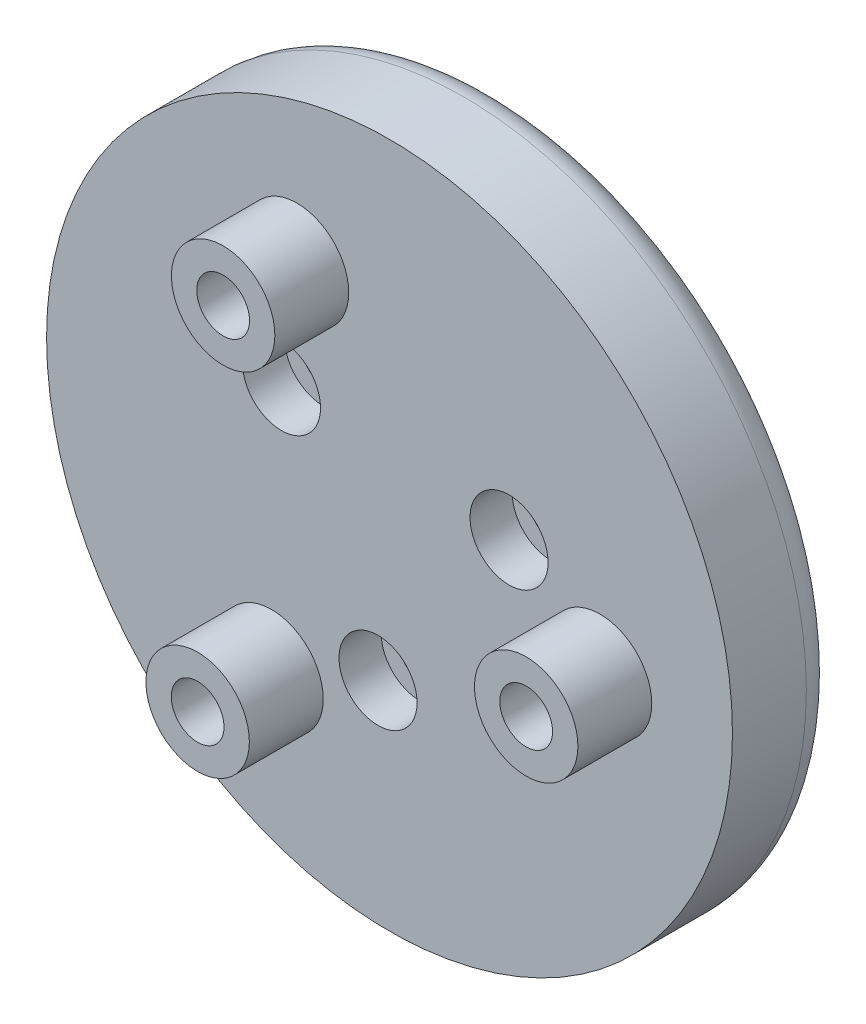
ISO-10303-21;
HEADER;
FILE_DESCRIPTION(('STEP AP214'),'2;1');
FILE_NAME('part.step','',(''),(''),'','','');
FILE_SCHEMA(('AUTOMOTIVE_DESIGN { 1 0 10303 214 1 1 1 1 }'));
ENDSEC;
DATA;
#1=APPLICATION_CONTEXT('core data for automotive mechanical design processes');
#2=APPLICATION_PROTOCOL_DEFINITION('international standard','automotive_design',2000,#1);
#3=PRODUCT_CONTEXT('',#1,'mechanical');
#4=PRODUCT('Part','Part','',(#3));
#5=PRODUCT_RELATED_PRODUCT_CATEGORY('part','',(#4));
#6=PRODUCT_DEFINITION_FORMATION('','',#4);
#7=PRODUCT_DEFINITION_CONTEXT('part definition',#1,'design');
#8=PRODUCT_DEFINITION('design','',#6,#7);
#9=PRODUCT_DEFINITION_SHAPE('','',#8);
#10=(LENGTH_UNIT() NAMED_UNIT(*) SI_UNIT(.MILLI.,.METRE.));
#11=(NAMED_UNIT(*) PLANE_ANGLE_UNIT() SI_UNIT($,.RADIAN.));
#12=(NAMED_UNIT(*) SI_UNIT($,.STERADIAN.) SOLID_ANGLE_UNIT());
#13=UNCERTAINTY_MEASURE_WITH_UNIT(LENGTH_MEASURE(1.E-05),#10,'distance_accuracy_value','');
#14=(GEOMETRIC_REPRESENTATION_CONTEXT(3) GLOBAL_UNCERTAINTY_ASSIGNED_CONTEXT((#13)) GLOBAL_UNIT_ASSIGNED_CONTEXT((#10,
#11,#12)) REPRESENTATION_CONTEXT('',''));
#15=CARTESIAN_POINT('',(0.,0.,0.));
#16=DIRECTION('',(0.,0.,1.));
#17=DIRECTION('',(1.,0.,0.));
#18=AXIS2_PLACEMENT_3D('',#15,#16,#17);
#19=CARTESIAN_POINT('',(-0.544723392172865,-6.22621686307341,5.));
#20=DIRECTION('',(0.,0.,-1.));
#21=DIRECTION('',(-1.,0.,0.));
#22=AXIS2_PLACEMENT_3D('',#19,#20,#21);
#23=CYLINDRICAL_SURFACE('',#22,1.);
#24=CARTESIAN_POINT('',(-0.544723392172865,-6.22621686307341,0.));
#25=DIRECTION('',(0.,0.,1.));
#26=DIRECTION('',(1.,0.,0.));
#27=AXIS2_PLACEMENT_3D('',#24,#25,#26);
#28=CIRCLE('',#27,1.);
#29=CARTESIAN_POINT('',(0.455276607827135,-6.22621686307341,0.));
#30=VERTEX_POINT('',#29);
#31=EDGE_CURVE('E117',#30,#30,#28,.T.);
#32=ORIENTED_EDGE('',*,*,#31,.F.);
#33=EDGE_LOOP('',(#32));
#34=FACE_BOUND('',#33,.T.);
#35=CARTESIAN_POINT('',(-0.544723392172865,-6.22621686307341,3.));
#36=DIRECTION('',(0.,0.,1.));
#37=DIRECTION('',(1.,0.,0.));
#38=AXIS2_PLACEMENT_3D('',#35,#36,#37);
#39=CIRCLE('',#38,1.);
#40=CARTESIAN_POINT('',(0.455276607827135,-6.22621686307341,3.));
#41=VERTEX_POINT('',#40);
#42=EDGE_CURVE('E34',#41,#41,#39,.T.);
#43=ORIENTED_EDGE('',*,*,#42,.T.);
#44=EDGE_LOOP('',(#43));
#45=FACE_BOUND('',#44,.T.);
#46=ADVANCED_FACE('F30',(#34,#45),#23,.F.);
#47=CARTESIAN_POINT('',(-5.11970027680618,3.58485272719406,5.));
#48=DIRECTION('',(0.,0.,-1.));
#49=DIRECTION('',(-1.,0.,0.));
#50=AXIS2_PLACEMENT_3D('',#47,#48,#49);
#51=CYLINDRICAL_SURFACE('',#50,1.);
#52=CARTESIAN_POINT('',(-5.11970027680618,3.58485272719406,0.));
#53=DIRECTION('',(0.,0.,1.));
#54=DIRECTION('',(1.,0.,0.));
#55=AXIS2_PLACEMENT_3D('',#52,#53,#54);
#56=CIRCLE('',#55,1.);
#57=CARTESIAN_POINT('',(-4.11970027680618,3.58485272719406,0.));
#58=VERTEX_POINT('',#57);
#59=EDGE_CURVE('E114',#58,#58,#56,.T.);
#60=ORIENTED_EDGE('',*,*,#59,.F.);
#61=EDGE_LOOP('',(#60));
#62=FACE_BOUND('',#61,.T.);
#63=CARTESIAN_POINT('',(-5.11970027680618,3.58485272719406,3.));
#64=DIRECTION('',(0.,0.,1.));
#65=DIRECTION('',(1.,0.,0.));
#66=AXIS2_PLACEMENT_3D('',#63,#64,#65);
#67=CIRCLE('',#66,1.);
#68=CARTESIAN_POINT('',(-4.11970027680618,3.58485272719406,3.));
#69=VERTEX_POINT('',#68);
#70=EDGE_CURVE('E51',#69,#69,#67,.T.);
#71=ORIENTED_EDGE('',*,*,#70,.T.);
#72=EDGE_LOOP('',(#71));
#73=FACE_BOUND('',#72,.T.);
#74=ADVANCED_FACE('F138',(#62,#73),#51,.F.);
#75=CARTESIAN_POINT('',(5.66442366897905,2.6413641358794,5.));
#76=DIRECTION('',(0.,0.,-1.));
#77=DIRECTION('',(-1.,0.,0.));
#78=AXIS2_PLACEMENT_3D('',#75,#76,#77);
#79=CYLINDRICAL_SURFACE('',#78,1.);
#80=CARTESIAN_POINT('',(5.66442366897905,2.6413641358794,0.));
#81=DIRECTION('',(0.,0.,1.));
#82=DIRECTION('',(1.,0.,0.));
#83=AXIS2_PLACEMENT_3D('',#80,#81,#82);
#84=CIRCLE('',#83,1.);
#85=CARTESIAN_POINT('',(6.66442366897905,2.6413641358794,0.));
#86=VERTEX_POINT('',#85);
#87=EDGE_CURVE('E111',#86,#86,#84,.T.);
#88=ORIENTED_EDGE('',*,*,#87,.F.);
#89=EDGE_LOOP('',(#88));
#90=FACE_BOUND('',#89,.T.);
#91=CARTESIAN_POINT('',(5.66442366897905,2.6413641358794,3.));
#92=DIRECTION('',(0.,0.,1.));
#93=DIRECTION('',(1.,0.,0.));
#94=AXIS2_PLACEMENT_3D('',#91,#92,#93);
#95=CIRCLE('',#94,1.);
#96=CARTESIAN_POINT('',(6.66442366897905,2.6413641358794,3.));
#97=VERTEX_POINT('',#96);
#98=EDGE_CURVE('E47',#97,#97,#95,.T.);
#99=ORIENTED_EDGE('',*,*,#98,.T.);
#100=EDGE_LOOP('',(#99));
#101=FACE_BOUND('',#100,.T.);
#102=ADVANCED_FACE('F144',(#90,#101),#79,.F.);
#103=CARTESIAN_POINT('',(0.,0.,5.));
#104=DIRECTION('',(0.,0.,1.));
#105=DIRECTION('',(1.,0.,0.));
#106=AXIS2_PLACEMENT_3D('',#103,#104,#105);
#107=PLANE('',#106);
#108=CARTESIAN_POINT('',(-5.11970027680618,3.58485272719406,5.));
#109=DIRECTION('',(0.,0.,1.));
#110=DIRECTION('',(1.,0.,0.));
#111=AXIS2_PLACEMENT_3D('',#108,#109,#110);
#112=CIRCLE('',#111,1.85);
#113=CARTESIAN_POINT('',(-3.26970027680618,3.58485272719406,5.));
#114=VERTEX_POINT('',#113);
#115=EDGE_CURVE('E59',#114,#114,#112,.T.);
#116=ORIENTED_EDGE('',*,*,#115,.F.);
#117=EDGE_LOOP('',(#116));
#118=FACE_BOUND('',#117,.T.);
#119=CARTESIAN_POINT('',(-0.544723392172865,-6.22621686307341,5.));
#120=DIRECTION('',(0.,0.,1.));
#121=DIRECTION('',(1.,0.,0.));
#122=AXIS2_PLACEMENT_3D('',#119,#120,#121);
#123=CIRCLE('',#122,1.85);
#124=CARTESIAN_POINT('',(1.30527660782714,-6.22621686307341,5.));
#125=VERTEX_POINT('',#124);
#126=EDGE_CURVE('E69',#125,#125,#123,.T.);
#127=ORIENTED_EDGE('',*,*,#126,.F.);
#128=EDGE_LOOP('',(#127));
#129=FACE_BOUND('',#128,.T.);
#130=CARTESIAN_POINT('',(5.66442366897905,2.6413641358794,5.));
#131=DIRECTION('',(0.,0.,1.));
#132=DIRECTION('',(1.,0.,0.));
#133=AXIS2_PLACEMENT_3D('',#130,#131,#132);
#134=CIRCLE('',#133,1.85);
#135=CARTESIAN_POINT('',(7.51442366897905,2.6413641358794,5.));
#136=VERTEX_POINT('',#135);
#137=EDGE_CURVE('E57',#136,#136,#134,.T.);
#138=ORIENTED_EDGE('',*,*,#137,.F.);
#139=EDGE_LOOP('',(#138));
#140=FACE_BOUND('',#139,.T.);
#141=CARTESIAN_POINT('',(9.97564050259824,-0.697564737441358,5.));
#142=DIRECTION('',(0.,0.,1.));
#143=DIRECTION('',(1.,0.,0.));
#144=AXIS2_PLACEMENT_3D('',#141,#142,#143);
#145=CIRCLE('',#144,2.45);
#146=CARTESIAN_POINT('',(12.4256405025982,-0.697564737441358,5.));
#147=VERTEX_POINT('',#146);
#148=EDGE_CURVE('E84',#147,#147,#145,.T.);
#149=ORIENTED_EDGE('',*,*,#148,.F.);
#150=EDGE_LOOP('',(#149));
#151=FACE_BOUND('',#150,.T.);
#152=CARTESIAN_POINT('',(-4.38371146789072,8.9879404629917,5.));
#153=DIRECTION('',(0.,0.,1.));
#154=DIRECTION('',(1.,0.,0.));
#155=AXIS2_PLACEMENT_3D('',#152,#153,#154);
#156=CIRCLE('',#155,2.45);
#157=CARTESIAN_POINT('',(-1.93371146789072,8.9879404629917,5.));
#158=VERTEX_POINT('',#157);
#159=EDGE_CURVE('E88',#158,#158,#156,.T.);
#160=ORIENTED_EDGE('',*,*,#159,.F.);
#161=EDGE_LOOP('',(#160));
#162=FACE_BOUND('',#161,.T.);
#163=CARTESIAN_POINT('',(-5.59192903470748,-8.29037572555041,5.));
#164=DIRECTION('',(0.,0.,1.));
#165=DIRECTION('',(1.,0.,0.));
#166=AXIS2_PLACEMENT_3D('',#163,#164,#165);
#167=CIRCLE('',#166,2.45);
#168=CARTESIAN_POINT('',(-3.14192903470748,-8.29037572555041,5.));
#169=VERTEX_POINT('',#168);
#170=EDGE_CURVE('E94',#169,#169,#167,.T.);
#171=ORIENTED_EDGE('',*,*,#170,.F.);
#172=EDGE_LOOP('',(#171));
#173=FACE_BOUND('',#172,.T.);
#174=CARTESIAN_POINT('',(0.,0.,5.));
#175=DIRECTION('',(0.,0.,1.));
#176=DIRECTION('',(1.,0.,0.));
#177=AXIS2_PLACEMENT_3D('',#174,#175,#176);
#178=CIRCLE('',#177,16.25);
#179=CARTESIAN_POINT('',(16.25,0.,5.));
#180=VERTEX_POINT('',#179);
#181=EDGE_CURVE('E43',#180,#180,#178,.T.);
#182=ORIENTED_EDGE('',*,*,#181,.T.);
#183=EDGE_LOOP('',(#182));
#184=FACE_BOUND('',#183,.T.);
#185=ADVANCED_FACE('F122',(#118,#129,#140,#151,#162,#173,#184),#107,.T.);
#186=CARTESIAN_POINT('',(0.,0.,0.));
#187=DIRECTION('',(0.,0.,1.));
#188=DIRECTION('',(1.,0.,0.));
#189=AXIS2_PLACEMENT_3D('',#186,#187,#188);
#190=PLANE('',#189);
#191=CARTESIAN_POINT('',(0.,0.,0.));
#192=DIRECTION('',(0.,0.,1.));
#193=DIRECTION('',(1.,0.,0.));
#194=AXIS2_PLACEMENT_3D('',#191,#192,#193);
#195=CIRCLE('',#194,14.75);
#196=CARTESIAN_POINT('',(14.75,0.,0.));
#197=VERTEX_POINT('',#196);
#198=EDGE_CURVE('E10',#197,#197,#195,.F.);
#199=ORIENTED_EDGE('',*,*,#198,.T.);
#200=EDGE_LOOP('',(#199));
#201=FACE_BOUND('',#200,.T.);
#202=ORIENTED_EDGE('',*,*,#31,.T.);
#203=EDGE_LOOP('',(#202));
#204=FACE_BOUND('',#203,.T.);
#205=ORIENTED_EDGE('',*,*,#59,.T.);
#206=EDGE_LOOP('',(#205));
#207=FACE_BOUND('',#206,.T.);
#208=ORIENTED_EDGE('',*,*,#87,.T.);
#209=EDGE_LOOP('',(#208));
#210=FACE_BOUND('',#209,.T.);
#211=CARTESIAN_POINT('',(-5.59192903470748,-8.29037572555041,0.));
#212=DIRECTION('',(0.,0.,1.));
#213=DIRECTION('',(1.,0.,0.));
#214=AXIS2_PLACEMENT_3D('',#211,#212,#213);
#215=CIRCLE('',#214,1.25);
#216=CARTESIAN_POINT('',(-4.34192903470748,-8.29037572555041,0.));
#217=VERTEX_POINT('',#216);
#218=EDGE_CURVE('E108',#217,#217,#215,.T.);
#219=ORIENTED_EDGE('',*,*,#218,.T.);
#220=EDGE_LOOP('',(#219));
#221=FACE_BOUND('',#220,.T.);
#222=CARTESIAN_POINT('',(-4.38371146789072,8.9879404629917,0.));
#223=DIRECTION('',(0.,0.,1.));
#224=DIRECTION('',(1.,0.,0.));
#225=AXIS2_PLACEMENT_3D('',#222,#223,#224);
#226=CIRCLE('',#225,1.25);
#227=CARTESIAN_POINT('',(-3.13371146789072,8.9879404629917,0.));
#228=VERTEX_POINT('',#227);
#229=EDGE_CURVE('E105',#228,#228,#226,.T.);
#230=ORIENTED_EDGE('',*,*,#229,.T.);
#231=EDGE_LOOP('',(#230));
#232=FACE_BOUND('',#231,.T.);
#233=CARTESIAN_POINT('',(9.97564050259824,-0.697564737441358,0.));
#234=DIRECTION('',(0.,0.,1.));
#235=DIRECTION('',(1.,0.,0.));
#236=AXIS2_PLACEMENT_3D('',#233,#234,#235);
#237=CIRCLE('',#236,1.25);
#238=CARTESIAN_POINT('',(11.2256405025982,-0.697564737441358,0.));
#239=VERTEX_POINT('',#238);
#240=EDGE_CURVE('E100',#239,#239,#237,.T.);
#241=ORIENTED_EDGE('',*,*,#240,.T.);
#242=EDGE_LOOP('',(#241));
#243=FACE_BOUND('',#242,.T.);
#244=ADVANCED_FACE('F127',(#201,#204,#207,#210,#221,#232,#243),#190,.F.);
#245=CARTESIAN_POINT('',(0.,0.,5.));
#246=DIRECTION('',(0.,0.,-1.));
#247=DIRECTION('',(-1.,0.,0.));
#248=AXIS2_PLACEMENT_3D('',#245,#246,#247);
#249=CYLINDRICAL_SURFACE('',#248,16.25);
#250=CARTESIAN_POINT('',(0.,0.,1.5));
#251=DIRECTION('',(0.,0.,1.));
#252=DIRECTION('',(1.,0.,0.));
#253=AXIS2_PLACEMENT_3D('',#250,#251,#252);
#254=CIRCLE('',#253,16.25);
#255=CARTESIAN_POINT('',(16.25,0.,1.5));
#256=VERTEX_POINT('',#255);
#257=EDGE_CURVE('E38',#256,#256,#254,.T.);
#258=ORIENTED_EDGE('',*,*,#257,.T.);
#259=EDGE_LOOP('',(#258));
#260=FACE_BOUND('',#259,.T.);
#261=ORIENTED_EDGE('',*,*,#181,.F.);
#262=EDGE_LOOP('',(#261));
#263=FACE_BOUND('',#262,.T.);
#264=ADVANCED_FACE('F124',(#260,#263),#249,.T.);
#265=CARTESIAN_POINT('',(-5.59192903470748,-8.29037572555041,5.));
#266=DIRECTION('',(0.,0.,-1.));
#267=DIRECTION('',(-1.,0.,0.));
#268=AXIS2_PLACEMENT_3D('',#265,#266,#267);
#269=CYLINDRICAL_SURFACE('',#268,1.25);
#270=ORIENTED_EDGE('',*,*,#218,.F.);
#271=EDGE_LOOP('',(#270));
#272=FACE_BOUND('',#271,.T.);
#273=CARTESIAN_POINT('',(-5.59192903470748,-8.29037572555041,8.5));
#274=DIRECTION('',(0.,0.,-1.));
#275=DIRECTION('',(-1.,0.,0.));
#276=AXIS2_PLACEMENT_3D('',#273,#274,#275);
#277=CIRCLE('',#276,1.25);
#278=CARTESIAN_POINT('',(-6.84192903470748,-8.29037572555041,8.5));
#279=VERTEX_POINT('',#278);
#280=EDGE_CURVE('E49',#279,#279,#277,.T.);
#281=ORIENTED_EDGE('',*,*,#280,.F.);
#282=EDGE_LOOP('',(#281));
#283=FACE_BOUND('',#282,.T.);
#284=ADVANCED_FACE('F126',(#272,#283),#269,.F.);
#285=CARTESIAN_POINT('',(-4.38371146789072,8.9879404629917,5.));
#286=DIRECTION('',(0.,0.,-1.));
#287=DIRECTION('',(-1.,0.,0.));
#288=AXIS2_PLACEMENT_3D('',#285,#286,#287);
#289=CYLINDRICAL_SURFACE('',#288,1.25);
#290=ORIENTED_EDGE('',*,*,#229,.F.);
#291=EDGE_LOOP('',(#290));
#292=FACE_BOUND('',#291,.T.);
#293=CARTESIAN_POINT('',(-4.38371146789072,8.9879404629917,8.5));
#294=DIRECTION('',(0.,0.,-1.));
#295=DIRECTION('',(-1.,0.,0.));
#296=AXIS2_PLACEMENT_3D('',#293,#294,#295);
#297=CIRCLE('',#296,1.25);
#298=CARTESIAN_POINT('',(-5.63371146789072,8.9879404629917,8.5));
#299=VERTEX_POINT('',#298);
#300=EDGE_CURVE('E79',#299,#299,#297,.T.);
#301=ORIENTED_EDGE('',*,*,#300,.F.);
#302=EDGE_LOOP('',(#301));
#303=FACE_BOUND('',#302,.T.);
#304=ADVANCED_FACE('F133',(#292,#303),#289,.F.);
#305=CARTESIAN_POINT('',(9.97564050259824,-0.697564737441358,5.));
#306=DIRECTION('',(0.,0.,-1.));
#307=DIRECTION('',(-1.,0.,0.));
#308=AXIS2_PLACEMENT_3D('',#305,#306,#307);
#309=CYLINDRICAL_SURFACE('',#308,1.25);
#310=ORIENTED_EDGE('',*,*,#240,.F.);
#311=EDGE_LOOP('',(#310));
#312=FACE_BOUND('',#311,.T.);
#313=CARTESIAN_POINT('',(9.97564050259824,-0.697564737441358,8.5));
#314=DIRECTION('',(0.,0.,-1.));
#315=DIRECTION('',(-1.,0.,0.));
#316=AXIS2_PLACEMENT_3D('',#313,#314,#315);
#317=CIRCLE('',#316,1.25);
#318=CARTESIAN_POINT('',(8.72564050259823,-0.697564737441358,8.5));
#319=VERTEX_POINT('',#318);
#320=EDGE_CURVE('E76',#319,#319,#317,.T.);
#321=ORIENTED_EDGE('',*,*,#320,.F.);
#322=EDGE_LOOP('',(#321));
#323=FACE_BOUND('',#322,.T.);
#324=ADVANCED_FACE('F181',(#312,#323),#309,.F.);
#325=CARTESIAN_POINT('',(0.,0.,1.5));
#326=DIRECTION('',(0.,0.,1.));
#327=DIRECTION('',(1.,0.,0.));
#328=AXIS2_PLACEMENT_3D('',#325,#326,#327);
#329=TOROIDAL_SURFACE('',#328,14.75,1.5);
#330=ORIENTED_EDGE('',*,*,#198,.F.);
#331=EDGE_LOOP('',(#330));
#332=FACE_BOUND('',#331,.T.);
#333=ORIENTED_EDGE('',*,*,#257,.F.);
#334=EDGE_LOOP('',(#333));
#335=FACE_BOUND('',#334,.T.);
#336=ADVANCED_FACE('F32',(#332,#335),#329,.T.);
#337=CARTESIAN_POINT('',(-5.59192903470748,-8.29037572555041,8.5));
#338=DIRECTION('',(0.,0.,-1.));
#339=DIRECTION('',(-1.,0.,0.));
#340=AXIS2_PLACEMENT_3D('',#337,#338,#339);
#341=CYLINDRICAL_SURFACE('',#340,2.45);
#342=CARTESIAN_POINT('',(-5.59192903470748,-8.29037572555041,8.5));
#343=DIRECTION('',(0.,0.,1.));
#344=DIRECTION('',(1.,0.,0.));
#345=AXIS2_PLACEMENT_3D('',#342,#343,#344);
#346=CIRCLE('',#345,2.45);
#347=CARTESIAN_POINT('',(-3.14192903470748,-8.29037572555041,8.5));
#348=VERTEX_POINT('',#347);
#349=EDGE_CURVE('E97',#348,#348,#346,.T.);
#350=ORIENTED_EDGE('',*,*,#349,.F.);
#351=EDGE_LOOP('',(#350));
#352=FACE_BOUND('',#351,.T.);
#353=ORIENTED_EDGE('',*,*,#170,.T.);
#354=EDGE_LOOP('',(#353));
#355=FACE_BOUND('',#354,.T.);
#356=ADVANCED_FACE('F169',(#352,#355),#341,.T.);
#357=CARTESIAN_POINT('',(-5.59192903470748,-8.29037572555041,8.5));
#358=DIRECTION('',(0.,0.,1.));
#359=DIRECTION('',(1.,0.,0.));
#360=AXIS2_PLACEMENT_3D('',#357,#358,#359);
#361=PLANE('',#360);
#362=ORIENTED_EDGE('',*,*,#280,.T.);
#363=EDGE_LOOP('',(#362));
#364=FACE_BOUND('',#363,.T.);
#365=ORIENTED_EDGE('',*,*,#349,.T.);
#366=EDGE_LOOP('',(#365));
#367=FACE_BOUND('',#366,.T.);
#368=ADVANCED_FACE('F171',(#364,#367),#361,.T.);
#369=CARTESIAN_POINT('',(-4.38371146789072,8.9879404629917,8.5));
#370=DIRECTION('',(0.,0.,-1.));
#371=DIRECTION('',(-1.,0.,0.));
#372=AXIS2_PLACEMENT_3D('',#369,#370,#371);
#373=CYLINDRICAL_SURFACE('',#372,2.45);
#374=CARTESIAN_POINT('',(-4.38371146789072,8.9879404629917,8.5));
#375=DIRECTION('',(0.,0.,1.));
#376=DIRECTION('',(1.,0.,0.));
#377=AXIS2_PLACEMENT_3D('',#374,#375,#376);
#378=CIRCLE('',#377,2.45);
#379=CARTESIAN_POINT('',(-1.93371146789072,8.9879404629917,8.5));
#380=VERTEX_POINT('',#379);
#381=EDGE_CURVE('E91',#380,#380,#378,.T.);
#382=ORIENTED_EDGE('',*,*,#381,.F.);
#383=EDGE_LOOP('',(#382));
#384=FACE_BOUND('',#383,.T.);
#385=ORIENTED_EDGE('',*,*,#159,.T.);
#386=EDGE_LOOP('',(#385));
#387=FACE_BOUND('',#386,.T.);
#388=ADVANCED_FACE('F178',(#384,#387),#373,.T.);
#389=CARTESIAN_POINT('',(-4.38371146789072,8.9879404629917,8.5));
#390=DIRECTION('',(0.,0.,1.));
#391=DIRECTION('',(1.,0.,0.));
#392=AXIS2_PLACEMENT_3D('',#389,#390,#391);
#393=PLANE('',#392);
#394=ORIENTED_EDGE('',*,*,#300,.T.);
#395=EDGE_LOOP('',(#394));
#396=FACE_BOUND('',#395,.T.);
#397=ORIENTED_EDGE('',*,*,#381,.T.);
#398=EDGE_LOOP('',(#397));
#399=FACE_BOUND('',#398,.T.);
#400=ADVANCED_FACE('F197',(#396,#399),#393,.T.);
#401=CARTESIAN_POINT('',(9.97564050259824,-0.697564737441358,8.5));
#402=DIRECTION('',(0.,0.,-1.));
#403=DIRECTION('',(-1.,0.,0.));
#404=AXIS2_PLACEMENT_3D('',#401,#402,#403);
#405=CYLINDRICAL_SURFACE('',#404,2.45);
#406=CARTESIAN_POINT('',(9.97564050259824,-0.697564737441358,8.5));
#407=DIRECTION('',(0.,0.,1.));
#408=DIRECTION('',(1.,0.,0.));
#409=AXIS2_PLACEMENT_3D('',#406,#407,#408);
#410=CIRCLE('',#409,2.45);
#411=CARTESIAN_POINT('',(12.4256405025982,-0.697564737441358,8.5));
#412=VERTEX_POINT('',#411);
#413=EDGE_CURVE('E85',#412,#412,#410,.T.);
#414=ORIENTED_EDGE('',*,*,#413,.F.);
#415=EDGE_LOOP('',(#414));
#416=FACE_BOUND('',#415,.T.);
#417=ORIENTED_EDGE('',*,*,#148,.T.);
#418=EDGE_LOOP('',(#417));
#419=FACE_BOUND('',#418,.T.);
#420=ADVANCED_FACE('F200',(#416,#419),#405,.T.);
#421=CARTESIAN_POINT('',(9.97564050259824,-0.697564737441358,8.5));
#422=DIRECTION('',(0.,0.,1.));
#423=DIRECTION('',(1.,0.,0.));
#424=AXIS2_PLACEMENT_3D('',#421,#422,#423);
#425=PLANE('',#424);
#426=ORIENTED_EDGE('',*,*,#320,.T.);
#427=EDGE_LOOP('',(#426));
#428=FACE_BOUND('',#427,.T.);
#429=ORIENTED_EDGE('',*,*,#413,.T.);
#430=EDGE_LOOP('',(#429));
#431=FACE_BOUND('',#430,.T.);
#432=ADVANCED_FACE('F211',(#428,#431),#425,.T.);
#433=CARTESIAN_POINT('',(5.66442366897905,2.6413641358794,3.));
#434=DIRECTION('',(0.,0.,1.));
#435=DIRECTION('',(1.,0.,0.));
#436=AXIS2_PLACEMENT_3D('',#433,#434,#435);
#437=CYLINDRICAL_SURFACE('',#436,1.85);
#438=CARTESIAN_POINT('',(5.66442366897905,2.6413641358794,3.));
#439=DIRECTION('',(0.,0.,1.));
#440=DIRECTION('',(1.,0.,0.));
#441=AXIS2_PLACEMENT_3D('',#438,#439,#440);
#442=CIRCLE('',#441,1.85);
#443=CARTESIAN_POINT('',(7.51442366897905,2.6413641358794,3.));
#444=VERTEX_POINT('',#443);
#445=EDGE_CURVE('E50',#444,#444,#442,.T.);
#446=ORIENTED_EDGE('',*,*,#445,.F.);
#447=EDGE_LOOP('',(#446));
#448=FACE_BOUND('',#447,.T.);
#449=ORIENTED_EDGE('',*,*,#137,.T.);
#450=EDGE_LOOP('',(#449));
#451=FACE_BOUND('',#450,.T.);
#452=ADVANCED_FACE('F215',(#448,#451),#437,.F.);
#453=CARTESIAN_POINT('',(5.66442366897905,2.6413641358794,3.));
#454=DIRECTION('',(0.,0.,1.));
#455=DIRECTION('',(1.,0.,0.));
#456=AXIS2_PLACEMENT_3D('',#453,#454,#455);
#457=PLANE('',#456);
#458=ORIENTED_EDGE('',*,*,#98,.F.);
#459=EDGE_LOOP('',(#458));
#460=FACE_BOUND('',#459,.T.);
#461=ORIENTED_EDGE('',*,*,#445,.T.);
#462=EDGE_LOOP('',(#461));
#463=FACE_BOUND('',#462,.T.);
#464=ADVANCED_FACE('F219',(#460,#463),#457,.T.);
#465=CARTESIAN_POINT('',(-5.11970027680618,3.58485272719406,3.));
#466=DIRECTION('',(0.,0.,1.));
#467=DIRECTION('',(1.,0.,0.));
#468=AXIS2_PLACEMENT_3D('',#465,#466,#467);
#469=CYLINDRICAL_SURFACE('',#468,1.85);
#470=CARTESIAN_POINT('',(-5.11970027680618,3.58485272719406,3.));
#471=DIRECTION('',(0.,0.,1.));
#472=DIRECTION('',(1.,0.,0.));
#473=AXIS2_PLACEMENT_3D('',#470,#471,#472);
#474=CIRCLE('',#473,1.85);
#475=CARTESIAN_POINT('',(-3.26970027680618,3.58485272719406,3.));
#476=VERTEX_POINT('',#475);
#477=EDGE_CURVE('E53',#476,#476,#474,.T.);
#478=ORIENTED_EDGE('',*,*,#477,.F.);
#479=EDGE_LOOP('',(#478));
#480=FACE_BOUND('',#479,.T.);
#481=ORIENTED_EDGE('',*,*,#115,.T.);
#482=EDGE_LOOP('',(#481));
#483=FACE_BOUND('',#482,.T.);
#484=ADVANCED_FACE('F223',(#480,#483),#469,.F.);
#485=CARTESIAN_POINT('',(-5.11970027680618,3.58485272719406,3.));
#486=DIRECTION('',(0.,0.,1.));
#487=DIRECTION('',(1.,0.,0.));
#488=AXIS2_PLACEMENT_3D('',#485,#486,#487);
#489=PLANE('',#488);
#490=ORIENTED_EDGE('',*,*,#70,.F.);
#491=EDGE_LOOP('',(#490));
#492=FACE_BOUND('',#491,.T.);
#493=ORIENTED_EDGE('',*,*,#477,.T.);
#494=EDGE_LOOP('',(#493));
#495=FACE_BOUND('',#494,.T.);
#496=ADVANCED_FACE('F229',(#492,#495),#489,.T.);
#497=CARTESIAN_POINT('',(-0.544723392172865,-6.22621686307341,3.));
#498=DIRECTION('',(0.,0.,1.));
#499=DIRECTION('',(1.,0.,0.));
#500=AXIS2_PLACEMENT_3D('',#497,#498,#499);
#501=CYLINDRICAL_SURFACE('',#500,1.85);
#502=CARTESIAN_POINT('',(-0.544723392172865,-6.22621686307341,3.));
#503=DIRECTION('',(0.,0.,1.));
#504=DIRECTION('',(1.,0.,0.));
#505=AXIS2_PLACEMENT_3D('',#502,#503,#504);
#506=CIRCLE('',#505,1.85);
#507=CARTESIAN_POINT('',(1.30527660782714,-6.22621686307341,3.));
#508=VERTEX_POINT('',#507);
#509=EDGE_CURVE('E64',#508,#508,#506,.T.);
#510=ORIENTED_EDGE('',*,*,#509,.F.);
#511=EDGE_LOOP('',(#510));
#512=FACE_BOUND('',#511,.T.);
#513=ORIENTED_EDGE('',*,*,#126,.T.);
#514=EDGE_LOOP('',(#513));
#515=FACE_BOUND('',#514,.T.);
#516=ADVANCED_FACE('F225',(#512,#515),#501,.F.);
#517=CARTESIAN_POINT('',(-0.544723392172865,-6.22621686307341,3.));
#518=DIRECTION('',(0.,0.,1.));
#519=DIRECTION('',(1.,0.,0.));
#520=AXIS2_PLACEMENT_3D('',#517,#518,#519);
#521=PLANE('',#520);
#522=ORIENTED_EDGE('',*,*,#42,.F.);
#523=EDGE_LOOP('',(#522));
#524=FACE_BOUND('',#523,.T.);
#525=ORIENTED_EDGE('',*,*,#509,.T.);
#526=EDGE_LOOP('',(#525));
#527=FACE_BOUND('',#526,.T.);
#528=ADVANCED_FACE('F228',(#524,#527),#521,.T.);
#529=CLOSED_SHELL('',(#46,#74,#102,#185,#244,#264,#284,#304,#324,#336,#356,#368,#388,#400,#420,
#432,#452,#464,#484,#496,#516,#528));
#530=MANIFOLD_SOLID_BREP('B2',#529);
#531=ADVANCED_BREP_SHAPE_REPRESENTATION('',(#18,#530),#14);
#532=SHAPE_DEFINITION_REPRESENTATION(#9,#531);
ENDSEC;
END-ISO-10303-21;
